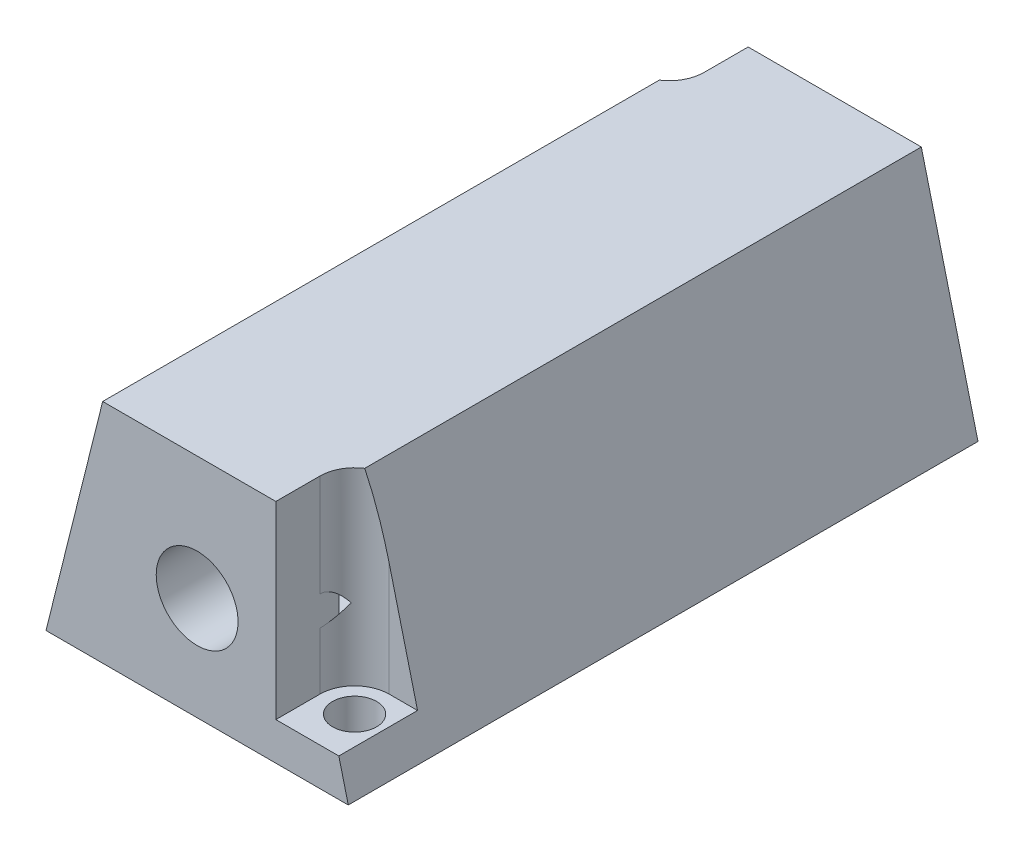
ISO-10303-21;
HEADER;
FILE_DESCRIPTION(('STEP AP214'),'2;1');
FILE_NAME('part.step','',(''),(''),'','','');
FILE_SCHEMA(('AUTOMOTIVE_DESIGN { 1 0 10303 214 1 1 1 1 }'));
ENDSEC;
DATA;
#1=APPLICATION_CONTEXT('core data for automotive mechanical design processes');
#2=APPLICATION_PROTOCOL_DEFINITION('international standard','automotive_design',2000,#1);
#3=PRODUCT_CONTEXT('',#1,'mechanical');
#4=PRODUCT('Part','Part','',(#3));
#5=PRODUCT_RELATED_PRODUCT_CATEGORY('part','',(#4));
#6=PRODUCT_DEFINITION_FORMATION('','',#4);
#7=PRODUCT_DEFINITION_CONTEXT('part definition',#1,'design');
#8=PRODUCT_DEFINITION('design','',#6,#7);
#9=PRODUCT_DEFINITION_SHAPE('','',#8);
#10=(LENGTH_UNIT() NAMED_UNIT(*) SI_UNIT(.MILLI.,.METRE.));
#11=(NAMED_UNIT(*) PLANE_ANGLE_UNIT() SI_UNIT($,.RADIAN.));
#12=(NAMED_UNIT(*) SI_UNIT($,.STERADIAN.) SOLID_ANGLE_UNIT());
#13=UNCERTAINTY_MEASURE_WITH_UNIT(LENGTH_MEASURE(1.E-05),#10,'distance_accuracy_value','');
#14=(GEOMETRIC_REPRESENTATION_CONTEXT(3) GLOBAL_UNCERTAINTY_ASSIGNED_CONTEXT((#13)) GLOBAL_UNIT_ASSIGNED_CONTEXT((#10,
#11,#12)) REPRESENTATION_CONTEXT('',''));
#15=CARTESIAN_POINT('',(0.,0.,0.));
#16=DIRECTION('',(0.,0.,1.));
#17=DIRECTION('',(1.,0.,0.));
#18=AXIS2_PLACEMENT_3D('',#15,#16,#17);
#19=CARTESIAN_POINT('',(8.36001491848114,22.3510638297872,50.));
#20=DIRECTION('',(0.,-1.,0.));
#21=DIRECTION('',(1.,0.,0.));
#22=AXIS2_PLACEMENT_3D('',#19,#20,#21);
#23=PLANE('',#22);
#24=DIRECTION('',(0.,0.,1.));
#25=VECTOR('',#24,1.);
#26=CARTESIAN_POINT('',(7.11001491848114,22.3510638297872,50.));
#27=LINE('',#26,#25);
#28=CARTESIAN_POINT('',(7.11001491848114,22.3510638297872,46.5));
#29=VERTEX_POINT('',#28);
#30=CARTESIAN_POINT('',(7.11001491848114,22.3510638297872,50.));
#31=VERTEX_POINT('',#30);
#32=EDGE_CURVE('E223',#29,#31,#27,.T.);
#33=ORIENTED_EDGE('',*,*,#32,.F.);
#34=CARTESIAN_POINT('',(9.86001491848114,22.3510638297872,46.5));
#35=DIRECTION('',(0.,-1.,0.));
#36=DIRECTION('',(1.,0.,0.));
#37=AXIS2_PLACEMENT_3D('',#34,#35,#36);
#38=CIRCLE('',#37,2.75);
#39=CARTESIAN_POINT('',(8.36001491848114,22.3510638297872,44.1951138856768));
#40=VERTEX_POINT('',#39);
#41=EDGE_CURVE('E230',#40,#29,#38,.F.);
#42=ORIENTED_EDGE('',*,*,#41,.F.);
#43=DIRECTION('',(0.,0.,-1.));
#44=VECTOR('',#43,1.);
#45=CARTESIAN_POINT('',(8.36001491848114,22.3510638297872,50.));
#46=LINE('',#45,#44);
#47=CARTESIAN_POINT('',(8.36001491848114,22.3510638297872,0.));
#48=VERTEX_POINT('',#47);
#49=EDGE_CURVE('E325',#40,#48,#46,.T.);
#50=ORIENTED_EDGE('',*,*,#49,.T.);
#51=DIRECTION('',(-1.,0.,0.));
#52=VECTOR('',#51,1.);
#53=CARTESIAN_POINT('',(8.36001491848114,22.3510638297872,0.));
#54=LINE('',#53,#52);
#55=CARTESIAN_POINT('',(-5.38998508151886,22.3510638297872,0.));
#56=VERTEX_POINT('',#55);
#57=EDGE_CURVE('E308',#48,#56,#54,.T.);
#58=ORIENTED_EDGE('',*,*,#57,.T.);
#59=DIRECTION('',(0.,0.,-1.));
#60=VECTOR('',#59,1.);
#61=CARTESIAN_POINT('',(-5.38998508151886,22.3510638297872,50.));
#62=LINE('',#61,#60);
#63=CARTESIAN_POINT('',(-5.38998508151886,22.3510638297872,3.50000000000003));
#64=VERTEX_POINT('',#63);
#65=EDGE_CURVE('E257',#64,#56,#62,.T.);
#66=ORIENTED_EDGE('',*,*,#65,.F.);
#67=CARTESIAN_POINT('',(-8.13998508151886,22.3510638297872,3.50000000000003));
#68=DIRECTION('',(0.,-1.,0.));
#69=DIRECTION('',(1.,0.,0.));
#70=AXIS2_PLACEMENT_3D('',#67,#68,#69);
#71=CIRCLE('',#70,2.75);
#72=CARTESIAN_POINT('',(-6.63998508151886,22.3510638297872,5.80488611432325));
#73=VERTEX_POINT('',#72);
#74=EDGE_CURVE('E262',#73,#64,#71,.F.);
#75=ORIENTED_EDGE('',*,*,#74,.F.);
#76=DIRECTION('',(0.,0.,-1.));
#77=VECTOR('',#76,1.);
#78=CARTESIAN_POINT('',(-6.63998508151886,22.3510638297872,50.));
#79=LINE('',#78,#77);
#80=CARTESIAN_POINT('',(-6.63998508151886,22.3510638297872,50.));
#81=VERTEX_POINT('',#80);
#82=EDGE_CURVE('E315',#81,#73,#79,.T.);
#83=ORIENTED_EDGE('',*,*,#82,.F.);
#84=DIRECTION('',(-1.,0.,0.));
#85=VECTOR('',#84,1.);
#86=CARTESIAN_POINT('',(8.36001491848114,22.3510638297872,50.));
#87=LINE('',#86,#85);
#88=EDGE_CURVE('E313',#31,#81,#87,.T.);
#89=ORIENTED_EDGE('',*,*,#88,.F.);
#90=EDGE_LOOP('',(#33,#42,#50,#58,#66,#75,#83,#89));
#91=FACE_BOUND('',#90,.T.);
#92=ADVANCED_FACE('F33',(#91),#23,.F.);
#93=CARTESIAN_POINT('',(0.,0.,50.));
#94=DIRECTION('',(0.,0.,1.));
#95=DIRECTION('',(1.,0.,0.));
#96=AXIS2_PLACEMENT_3D('',#93,#94,#95);
#97=PLANE('',#96);
#98=CARTESIAN_POINT('',(0.860014918481134,12.5649359562244,50.));
#99=DIRECTION('',(0.,0.,-1.));
#100=DIRECTION('',(-1.,0.,0.));
#101=AXIS2_PLACEMENT_3D('',#98,#99,#100);
#102=CIRCLE('',#101,3.25);
#103=CARTESIAN_POINT('',(-2.38998508151887,12.5649359562244,50.));
#104=VERTEX_POINT('',#103);
#105=EDGE_CURVE('E497',#104,#104,#102,.T.);
#106=ORIENTED_EDGE('',*,*,#105,.T.);
#107=EDGE_LOOP('',(#106));
#108=FACE_BOUND('',#107,.T.);
#109=DIRECTION('',(-1.,0.,0.));
#110=VECTOR('',#109,1.);
#111=CARTESIAN_POINT('',(0.,7.35106382978723,50.));
#112=LINE('',#111,#110);
#113=CARTESIAN_POINT('',(12.1100149184811,7.35106382978723,50.));
#114=VERTEX_POINT('',#113);
#115=CARTESIAN_POINT('',(7.11001491848114,7.35106382978723,50.));
#116=VERTEX_POINT('',#115);
#117=EDGE_CURVE('E217',#114,#116,#112,.T.);
#118=ORIENTED_EDGE('',*,*,#117,.T.);
#119=DIRECTION('',(0.,1.,0.));
#120=VECTOR('',#119,1.);
#121=CARTESIAN_POINT('',(7.11001491848114,0.,50.));
#122=LINE('',#121,#120);
#123=EDGE_CURVE('E220',#116,#31,#122,.T.);
#124=ORIENTED_EDGE('',*,*,#123,.T.);
#125=ORIENTED_EDGE('',*,*,#88,.T.);
#126=DIRECTION('',(-0.242535625036333,-0.970142500145332,0.));
#127=VECTOR('',#126,1.);
#128=CARTESIAN_POINT('',(-6.63998508151886,22.3510638297872,50.));
#129=LINE('',#128,#127);
#130=CARTESIAN_POINT('',(-11.1399850815189,4.35106382978723,50.));
#131=VERTEX_POINT('',#130);
#132=EDGE_CURVE('E304',#81,#131,#129,.T.);
#133=ORIENTED_EDGE('',*,*,#132,.T.);
#134=DIRECTION('',(1.,0.,0.));
#135=VECTOR('',#134,1.);
#136=CARTESIAN_POINT('',(-11.1399850815189,4.35106382978723,50.));
#137=LINE('',#136,#135);
#138=CARTESIAN_POINT('',(12.8600149184811,4.35106382978723,50.));
#139=VERTEX_POINT('',#138);
#140=EDGE_CURVE('E307',#131,#139,#137,.T.);
#141=ORIENTED_EDGE('',*,*,#140,.T.);
#142=DIRECTION('',(-0.242535625036333,0.970142500145332,0.));
#143=VECTOR('',#142,1.);
#144=CARTESIAN_POINT('',(12.8600149184811,4.35106382978723,50.));
#145=LINE('',#144,#143);
#146=EDGE_CURVE('E310',#139,#114,#145,.T.);
#147=ORIENTED_EDGE('',*,*,#146,.T.);
#148=EDGE_LOOP('',(#118,#124,#125,#133,#141,#147));
#149=FACE_BOUND('',#148,.T.);
#150=ADVANCED_FACE('F433',(#108,#149),#97,.T.);
#151=CARTESIAN_POINT('',(12.8600149184811,4.35106382978723,50.));
#152=DIRECTION('',(-0.970142500145332,-0.242535625036333,0.));
#153=DIRECTION('',(0.242535625036333,-0.970142500145332,0.));
#154=AXIS2_PLACEMENT_3D('',#151,#152,#153);
#155=PLANE('',#154);
#156=CARTESIAN_POINT('',(9.86001491848114,16.3510638297872,46.5));
#157=DIRECTION('',(-0.970142500145332,-0.242535625036333,0.));
#158=DIRECTION('',(0.242535625036333,-0.970142500145332,0.));
#159=AXIS2_PLACEMENT_3D('',#156,#157,#158);
#160=ELLIPSE('',#159,11.3385404704486,2.75);
#161=CARTESIAN_POINT('',(9.86001491848111,16.3510638297875,43.75));
#162=VERTEX_POINT('',#161);
#163=EDGE_CURVE('E228',#162,#40,#160,.F.);
#164=ORIENTED_EDGE('',*,*,#163,.F.);
#165=DIRECTION('',(-0.242535625036333,0.970142500145332,0.));
#166=VECTOR('',#165,1.);
#167=CARTESIAN_POINT('',(12.8600149184811,4.35106382978723,43.75));
#168=LINE('',#167,#166);
#169=CARTESIAN_POINT('',(12.1100149184811,7.35106382978723,43.75));
#170=VERTEX_POINT('',#169);
#171=EDGE_CURVE('E42',#170,#162,#168,.T.);
#172=ORIENTED_EDGE('',*,*,#171,.F.);
#173=DIRECTION('',(0.,0.,-1.));
#174=VECTOR('',#173,1.);
#175=CARTESIAN_POINT('',(12.1100149184811,7.35106382978723,50.));
#176=LINE('',#175,#174);
#177=EDGE_CURVE('E202',#114,#170,#176,.T.);
#178=ORIENTED_EDGE('',*,*,#177,.F.);
#179=ORIENTED_EDGE('',*,*,#146,.F.);
#180=DIRECTION('',(0.,0.,-1.));
#181=VECTOR('',#180,1.);
#182=CARTESIAN_POINT('',(12.8600149184811,4.35106382978723,50.));
#183=LINE('',#182,#181);
#184=CARTESIAN_POINT('',(12.8600149184811,4.35106382978723,0.));
#185=VERTEX_POINT('',#184);
#186=EDGE_CURVE('E327',#139,#185,#183,.T.);
#187=ORIENTED_EDGE('',*,*,#186,.T.);
#188=DIRECTION('',(-0.242535625036333,0.970142500145332,0.));
#189=VECTOR('',#188,1.);
#190=CARTESIAN_POINT('',(12.8600149184811,4.35106382978723,0.));
#191=LINE('',#190,#189);
#192=EDGE_CURVE('E319',#185,#48,#191,.T.);
#193=ORIENTED_EDGE('',*,*,#192,.T.);
#194=ORIENTED_EDGE('',*,*,#49,.F.);
#195=EDGE_LOOP('',(#164,#172,#178,#179,#187,#193,#194));
#196=FACE_BOUND('',#195,.T.);
#197=ADVANCED_FACE('F377',(#196),#155,.F.);
#198=CARTESIAN_POINT('',(4.32411653361889,7.06493595622438,50.));
#199=DIRECTION('',(-0.866025403784439,0.499999999999999,0.));
#200=DIRECTION('',(-0.5,-0.866025403784439,0.));
#201=AXIS2_PLACEMENT_3D('',#198,#199,#200);
#202=PLANE('',#201);
#203=DIRECTION('',(0.,0.,-1.));
#204=VECTOR('',#203,1.);
#205=CARTESIAN_POINT('',(7.11001491848114,11.8902535035299,50.));
#206=LINE('',#205,#204);
#207=CARTESIAN_POINT('',(7.11001491848114,11.8902535035299,46.5));
#208=VERTEX_POINT('',#207);
#209=CARTESIAN_POINT('',(7.11001491848114,11.8902535035299,45.));
#210=VERTEX_POINT('',#209);
#211=EDGE_CURVE('E356',#208,#210,#206,.T.);
#212=ORIENTED_EDGE('',*,*,#211,.F.);
#213=CARTESIAN_POINT('',(9.86001491848114,16.6533932243443,46.5));
#214=DIRECTION('',(-0.866025403784439,0.499999999999999,0.));
#215=DIRECTION('',(-0.5,-0.866025403784439,0.));
#216=AXIS2_PLACEMENT_3D('',#213,#214,#215);
#217=ELLIPSE('',#216,5.50000000000001,2.75);
#218=CARTESIAN_POINT('',(7.78821814875665,13.0649359562244,44.691642141345));
#219=VERTEX_POINT('',#218);
#220=EDGE_CURVE('E225',#208,#219,#217,.F.);
#221=ORIENTED_EDGE('',*,*,#220,.T.);
#222=DIRECTION('',(0.,0.,-1.));
#223=VECTOR('',#222,1.);
#224=CARTESIAN_POINT('',(7.78821814875665,13.0649359562244,50.));
#225=LINE('',#224,#223);
#226=CARTESIAN_POINT('',(7.78821814875665,13.0649359562244,0.));
#227=VERTEX_POINT('',#226);
#228=EDGE_CURVE('E295',#219,#227,#225,.T.);
#229=ORIENTED_EDGE('',*,*,#228,.T.);
#230=DIRECTION('',(0.499999999999999,0.866025403784439,0.));
#231=VECTOR('',#230,1.);
#232=CARTESIAN_POINT('',(4.32411653361889,7.06493595622438,0.));
#233=LINE('',#232,#231);
#234=CARTESIAN_POINT('',(4.32411653361889,7.06493595622438,0.));
#235=VERTEX_POINT('',#234);
#236=EDGE_CURVE('E282',#235,#227,#233,.T.);
#237=ORIENTED_EDGE('',*,*,#236,.F.);
#238=DIRECTION('',(0.,0.,-1.));
#239=VECTOR('',#238,1.);
#240=CARTESIAN_POINT('',(4.32411653361889,7.06493595622438,50.));
#241=LINE('',#240,#239);
#242=CARTESIAN_POINT('',(4.32411653361889,7.06493595622438,45.));
#243=VERTEX_POINT('',#242);
#244=EDGE_CURVE('E297',#243,#235,#241,.T.);
#245=ORIENTED_EDGE('',*,*,#244,.F.);
#246=DIRECTION('',(-0.5,-0.866025403784439,0.));
#247=VECTOR('',#246,1.);
#248=CARTESIAN_POINT('',(4.32411653361889,7.06493595622438,45.));
#249=LINE('',#248,#247);
#250=EDGE_CURVE('E49',#210,#243,#249,.T.);
#251=ORIENTED_EDGE('',*,*,#250,.F.);
#252=EDGE_LOOP('',(#212,#221,#229,#237,#245,#251));
#253=FACE_BOUND('',#252,.T.);
#254=ADVANCED_FACE('F411',(#253),#202,.T.);
#255=CARTESIAN_POINT('',(7.78821814875665,13.0649359562244,50.));
#256=DIRECTION('',(-0.866025403784438,-0.5,0.));
#257=DIRECTION('',(0.5,-0.866025403784439,0.));
#258=AXIS2_PLACEMENT_3D('',#255,#256,#257);
#259=PLANE('',#258);
#260=DIRECTION('',(0.,0.,1.));
#261=VECTOR('',#260,1.);
#262=CARTESIAN_POINT('',(7.11001491848114,14.2396184089189,50.));
#263=LINE('',#262,#261);
#264=CARTESIAN_POINT('',(7.11001491848114,14.2396184089189,45.));
#265=VERTEX_POINT('',#264);
#266=CARTESIAN_POINT('',(7.11001491848114,14.2396184089189,46.5));
#267=VERTEX_POINT('',#266);
#268=EDGE_CURVE('E57',#265,#267,#263,.T.);
#269=ORIENTED_EDGE('',*,*,#268,.F.);
#270=DIRECTION('',(0.5,-0.866025403784439,0.));
#271=VECTOR('',#270,1.);
#272=CARTESIAN_POINT('',(7.78821814875665,13.0649359562244,45.));
#273=LINE('',#272,#271);
#274=CARTESIAN_POINT('',(4.32411653361889,19.0649359562244,45.));
#275=VERTEX_POINT('',#274);
#276=EDGE_CURVE('E359',#275,#265,#273,.T.);
#277=ORIENTED_EDGE('',*,*,#276,.F.);
#278=DIRECTION('',(0.,0.,-1.));
#279=VECTOR('',#278,1.);
#280=CARTESIAN_POINT('',(4.32411653361889,19.0649359562244,50.));
#281=LINE('',#280,#279);
#282=CARTESIAN_POINT('',(4.32411653361889,19.0649359562244,0.));
#283=VERTEX_POINT('',#282);
#284=EDGE_CURVE('E293',#275,#283,#281,.T.);
#285=ORIENTED_EDGE('',*,*,#284,.T.);
#286=DIRECTION('',(-0.5,0.866025403784438,0.));
#287=VECTOR('',#286,1.);
#288=CARTESIAN_POINT('',(7.78821814875665,13.0649359562244,0.));
#289=LINE('',#288,#287);
#290=EDGE_CURVE('E285',#227,#283,#289,.T.);
#291=ORIENTED_EDGE('',*,*,#290,.F.);
#292=ORIENTED_EDGE('',*,*,#228,.F.);
#293=CARTESIAN_POINT('',(9.86001491848114,9.47647868810449,46.5));
#294=DIRECTION('',(-0.866025403784438,-0.5,0.));
#295=DIRECTION('',(0.5,-0.866025403784439,0.));
#296=AXIS2_PLACEMENT_3D('',#293,#294,#295);
#297=ELLIPSE('',#296,5.5,2.75);
#298=EDGE_CURVE('E342',#219,#267,#297,.F.);
#299=ORIENTED_EDGE('',*,*,#298,.T.);
#300=EDGE_LOOP('',(#269,#277,#285,#291,#292,#299));
#301=FACE_BOUND('',#300,.T.);
#302=ADVANCED_FACE('F346',(#301),#259,.T.);
#303=CARTESIAN_POINT('',(9.86001491848114,54.3510638297872,46.5));
#304=DIRECTION('',(0.,-1.,0.));
#305=DIRECTION('',(0.,0.,-1.));
#306=AXIS2_PLACEMENT_3D('',#303,#304,#305);
#307=CYLINDRICAL_SURFACE('',#306,1.75);
#308=CARTESIAN_POINT('',(9.86001491848114,4.35106382978723,46.5));
#309=DIRECTION('',(0.,-1.,0.));
#310=DIRECTION('',(0.,0.,1.));
#311=AXIS2_PLACEMENT_3D('',#308,#309,#310);
#312=CIRCLE('',#311,1.75);
#313=CARTESIAN_POINT('',(9.86001491848114,4.35106382978723,48.25));
#314=VERTEX_POINT('',#313);
#315=EDGE_CURVE('E267',#314,#314,#312,.T.);
#316=ORIENTED_EDGE('',*,*,#315,.T.);
#317=EDGE_LOOP('',(#316));
#318=FACE_BOUND('',#317,.T.);
#319=CARTESIAN_POINT('',(9.86001491848114,7.35106382978723,46.5));
#320=DIRECTION('',(0.,1.,0.));
#321=DIRECTION('',(0.,0.,1.));
#322=AXIS2_PLACEMENT_3D('',#319,#320,#321);
#323=CIRCLE('',#322,1.75);
#324=CARTESIAN_POINT('',(9.86001491848114,7.35106382978723,48.25));
#325=VERTEX_POINT('',#324);
#326=EDGE_CURVE('E210',#325,#325,#323,.F.);
#327=ORIENTED_EDGE('',*,*,#326,.F.);
#328=EDGE_LOOP('',(#327));
#329=FACE_BOUND('',#328,.T.);
#330=ADVANCED_FACE('F466',(#318,#329),#307,.F.);
#331=CARTESIAN_POINT('',(0.,0.,0.));
#332=DIRECTION('',(0.,0.,1.));
#333=DIRECTION('',(1.,0.,0.));
#334=AXIS2_PLACEMENT_3D('',#331,#332,#333);
#335=PLANE('',#334);
#336=DIRECTION('',(0.,-1.,0.));
#337=VECTOR('',#336,1.);
#338=CARTESIAN_POINT('',(-5.38998508151886,0.,0.));
#339=LINE('',#338,#337);
#340=CARTESIAN_POINT('',(-5.38998508151886,14.2396184089189,0.));
#341=VERTEX_POINT('',#340);
#342=EDGE_CURVE('E254',#56,#341,#339,.T.);
#343=ORIENTED_EDGE('',*,*,#342,.F.);
#344=ORIENTED_EDGE('',*,*,#57,.F.);
#345=ORIENTED_EDGE('',*,*,#192,.F.);
#346=DIRECTION('',(1.,0.,0.));
#347=VECTOR('',#346,1.);
#348=CARTESIAN_POINT('',(-11.1399850815189,4.35106382978723,0.));
#349=LINE('',#348,#347);
#350=CARTESIAN_POINT('',(-11.1399850815189,4.35106382978723,0.));
#351=VERTEX_POINT('',#350);
#352=EDGE_CURVE('E317',#351,#185,#349,.T.);
#353=ORIENTED_EDGE('',*,*,#352,.F.);
#354=DIRECTION('',(-0.242535625036333,-0.970142500145332,0.));
#355=VECTOR('',#354,1.);
#356=CARTESIAN_POINT('',(-6.63998508151886,22.3510638297872,0.));
#357=LINE('',#356,#355);
#358=CARTESIAN_POINT('',(-10.3899850815189,7.35106382978723,0.));
#359=VERTEX_POINT('',#358);
#360=EDGE_CURVE('E303',#359,#351,#357,.T.);
#361=ORIENTED_EDGE('',*,*,#360,.F.);
#362=DIRECTION('',(-1.,0.,0.));
#363=VECTOR('',#362,1.);
#364=CARTESIAN_POINT('',(0.,7.35106382978723,0.));
#365=LINE('',#364,#363);
#366=CARTESIAN_POINT('',(-5.38998508151886,7.35106382978723,0.));
#367=VERTEX_POINT('',#366);
#368=EDGE_CURVE('E249',#367,#359,#365,.T.);
#369=ORIENTED_EDGE('',*,*,#368,.F.);
#370=CARTESIAN_POINT('',(-5.38998508151886,11.8902535035299,0.));
#371=VERTEX_POINT('',#370);
#372=EDGE_CURVE('E251',#371,#367,#339,.T.);
#373=ORIENTED_EDGE('',*,*,#372,.F.);
#374=DIRECTION('',(0.5,-0.866025403784438,0.));
#375=VECTOR('',#374,1.);
#376=CARTESIAN_POINT('',(-6.06818831179437,13.0649359562244,0.));
#377=LINE('',#376,#375);
#378=CARTESIAN_POINT('',(-2.60408669665662,7.06493595622438,0.));
#379=VERTEX_POINT('',#378);
#380=EDGE_CURVE('E276',#371,#379,#377,.T.);
#381=ORIENTED_EDGE('',*,*,#380,.T.);
#382=DIRECTION('',(1.,0.,0.));
#383=VECTOR('',#382,1.);
#384=CARTESIAN_POINT('',(-2.60408669665662,7.06493595622438,0.));
#385=LINE('',#384,#383);
#386=EDGE_CURVE('E279',#379,#235,#385,.T.);
#387=ORIENTED_EDGE('',*,*,#386,.T.);
#388=ORIENTED_EDGE('',*,*,#236,.T.);
#389=ORIENTED_EDGE('',*,*,#290,.T.);
#390=DIRECTION('',(-1.,0.,0.));
#391=VECTOR('',#390,1.);
#392=CARTESIAN_POINT('',(4.32411653361889,19.0649359562244,0.));
#393=LINE('',#392,#391);
#394=CARTESIAN_POINT('',(-2.60408669665662,19.0649359562244,0.));
#395=VERTEX_POINT('',#394);
#396=EDGE_CURVE('E288',#283,#395,#393,.T.);
#397=ORIENTED_EDGE('',*,*,#396,.T.);
#398=DIRECTION('',(-0.5,-0.866025403784439,0.));
#399=VECTOR('',#398,1.);
#400=CARTESIAN_POINT('',(-2.60408669665662,19.0649359562244,0.));
#401=LINE('',#400,#399);
#402=EDGE_CURVE('E273',#395,#341,#401,.T.);
#403=ORIENTED_EDGE('',*,*,#402,.T.);
#404=EDGE_LOOP('',(#343,#344,#345,#353,#361,#369,#373,#381,#387,#388,#389,#397,#403));
#405=FACE_BOUND('',#404,.T.);
#406=ADVANCED_FACE('F385',(#405),#335,.F.);
#407=CARTESIAN_POINT('',(-6.63998508151886,22.3510638297872,50.));
#408=DIRECTION('',(0.970142500145332,-0.242535625036333,0.));
#409=DIRECTION('',(0.242535625036333,0.970142500145332,0.));
#410=AXIS2_PLACEMENT_3D('',#407,#408,#409);
#411=PLANE('',#410);
#412=CARTESIAN_POINT('',(-8.13998508151886,16.3510638297872,3.50000000000003));
#413=DIRECTION('',(0.970142500145332,-0.242535625036333,0.));
#414=DIRECTION('',(-0.242535625036333,-0.970142500145332,0.));
#415=AXIS2_PLACEMENT_3D('',#412,#413,#414);
#416=ELLIPSE('',#415,11.3385404704486,2.75);
#417=CARTESIAN_POINT('',(-8.13998508151886,16.3510638297872,6.25000000000003));
#418=VERTEX_POINT('',#417);
#419=EDGE_CURVE('E264',#418,#73,#416,.F.);
#420=ORIENTED_EDGE('',*,*,#419,.F.);
#421=DIRECTION('',(0.242535625036333,0.970142500145332,0.));
#422=VECTOR('',#421,1.);
#423=CARTESIAN_POINT('',(-6.63998508151886,22.3510638297873,6.25000000000004));
#424=LINE('',#423,#422);
#425=CARTESIAN_POINT('',(-10.3899850815189,7.35106382978723,6.25000000000002));
#426=VERTEX_POINT('',#425);
#427=EDGE_CURVE('E341',#426,#418,#424,.T.);
#428=ORIENTED_EDGE('',*,*,#427,.F.);
#429=DIRECTION('',(0.,0.,1.));
#430=VECTOR('',#429,1.);
#431=CARTESIAN_POINT('',(-10.3899850815189,7.35106382978723,50.));
#432=LINE('',#431,#430);
#433=EDGE_CURVE('E247',#359,#426,#432,.T.);
#434=ORIENTED_EDGE('',*,*,#433,.F.);
#435=ORIENTED_EDGE('',*,*,#360,.T.);
#436=DIRECTION('',(0.,0.,-1.));
#437=VECTOR('',#436,1.);
#438=CARTESIAN_POINT('',(-11.1399850815189,4.35106382978723,50.));
#439=LINE('',#438,#437);
#440=EDGE_CURVE('E330',#131,#351,#439,.T.);
#441=ORIENTED_EDGE('',*,*,#440,.F.);
#442=ORIENTED_EDGE('',*,*,#132,.F.);
#443=ORIENTED_EDGE('',*,*,#82,.T.);
#444=EDGE_LOOP('',(#420,#428,#434,#435,#441,#442,#443));
#445=FACE_BOUND('',#444,.T.);
#446=ADVANCED_FACE('F35',(#445),#411,.F.);
#447=CARTESIAN_POINT('',(-2.60408669665662,19.0649359562244,50.));
#448=DIRECTION('',(0.866025403784439,-0.5,0.));
#449=DIRECTION('',(0.5,0.866025403784439,0.));
#450=AXIS2_PLACEMENT_3D('',#447,#448,#449);
#451=PLANE('',#450);
#452=DIRECTION('',(0.5,0.866025403784439,0.));
#453=VECTOR('',#452,1.);
#454=CARTESIAN_POINT('',(-2.60408669665662,19.0649359562244,45.));
#455=LINE('',#454,#453);
#456=CARTESIAN_POINT('',(-6.06818831179437,13.0649359562244,45.));
#457=VERTEX_POINT('',#456);
#458=CARTESIAN_POINT('',(-2.60408669665662,19.0649359562244,45.));
#459=VERTEX_POINT('',#458);
#460=EDGE_CURVE('E355',#457,#459,#455,.T.);
#461=ORIENTED_EDGE('',*,*,#460,.F.);
#462=DIRECTION('',(0.,0.,-1.));
#463=VECTOR('',#462,1.);
#464=CARTESIAN_POINT('',(-6.06818831179437,13.0649359562244,50.));
#465=LINE('',#464,#463);
#466=CARTESIAN_POINT('',(-6.06818831179437,13.0649359562244,5.30835785865501));
#467=VERTEX_POINT('',#466);
#468=EDGE_CURVE('E301',#457,#467,#465,.T.);
#469=ORIENTED_EDGE('',*,*,#468,.T.);
#470=CARTESIAN_POINT('',(-8.13998508151886,9.47647868810447,3.50000000000003));
#471=DIRECTION('',(0.866025403784439,-0.5,0.));
#472=DIRECTION('',(-0.5,-0.866025403784439,0.));
#473=AXIS2_PLACEMENT_3D('',#470,#471,#472);
#474=ELLIPSE('',#473,5.50000000000001,2.75);
#475=CARTESIAN_POINT('',(-5.38998508151886,14.2396184089189,3.50000000000003));
#476=VERTEX_POINT('',#475);
#477=EDGE_CURVE('E259',#467,#476,#474,.F.);
#478=ORIENTED_EDGE('',*,*,#477,.T.);
#479=DIRECTION('',(0.,0.,-1.));
#480=VECTOR('',#479,1.);
#481=CARTESIAN_POINT('',(-5.38998508151886,14.2396184089189,50.));
#482=LINE('',#481,#480);
#483=EDGE_CURVE('E253',#476,#341,#482,.T.);
#484=ORIENTED_EDGE('',*,*,#483,.T.);
#485=ORIENTED_EDGE('',*,*,#402,.F.);
#486=DIRECTION('',(0.,0.,-1.));
#487=VECTOR('',#486,1.);
#488=CARTESIAN_POINT('',(-2.60408669665662,19.0649359562244,50.));
#489=LINE('',#488,#487);
#490=EDGE_CURVE('E291',#459,#395,#489,.T.);
#491=ORIENTED_EDGE('',*,*,#490,.F.);
#492=EDGE_LOOP('',(#461,#469,#478,#484,#485,#491));
#493=FACE_BOUND('',#492,.T.);
#494=ADVANCED_FACE('F398',(#493),#451,.T.);
#495=CARTESIAN_POINT('',(-6.06818831179437,13.0649359562244,50.));
#496=DIRECTION('',(0.866025403784438,0.5,0.));
#497=DIRECTION('',(-0.5,0.866025403784439,0.));
#498=AXIS2_PLACEMENT_3D('',#495,#496,#497);
#499=PLANE('',#498);
#500=DIRECTION('',(-0.5,0.866025403784439,0.));
#501=VECTOR('',#500,1.);
#502=CARTESIAN_POINT('',(-6.06818831179437,13.0649359562244,45.));
#503=LINE('',#502,#501);
#504=CARTESIAN_POINT('',(-2.60408669665662,7.06493595622438,45.));
#505=VERTEX_POINT('',#504);
#506=EDGE_CURVE('E365',#505,#457,#503,.T.);
#507=ORIENTED_EDGE('',*,*,#506,.F.);
#508=DIRECTION('',(0.,0.,-1.));
#509=VECTOR('',#508,1.);
#510=CARTESIAN_POINT('',(-2.60408669665662,7.06493595622438,50.));
#511=LINE('',#510,#509);
#512=EDGE_CURVE('E299',#505,#379,#511,.T.);
#513=ORIENTED_EDGE('',*,*,#512,.T.);
#514=ORIENTED_EDGE('',*,*,#380,.F.);
#515=DIRECTION('',(0.,0.,1.));
#516=VECTOR('',#515,1.);
#517=CARTESIAN_POINT('',(-5.38998508151886,11.8902535035299,50.));
#518=LINE('',#517,#516);
#519=CARTESIAN_POINT('',(-5.38998508151886,11.8902535035299,3.50000000000003));
#520=VERTEX_POINT('',#519);
#521=EDGE_CURVE('E333',#371,#520,#518,.T.);
#522=ORIENTED_EDGE('',*,*,#521,.T.);
#523=CARTESIAN_POINT('',(-8.13998508151886,16.6533932243443,3.50000000000003));
#524=DIRECTION('',(0.866025403784438,0.5,0.));
#525=DIRECTION('',(0.5,-0.866025403784439,0.));
#526=AXIS2_PLACEMENT_3D('',#523,#524,#525);
#527=ELLIPSE('',#526,5.5,2.75);
#528=EDGE_CURVE('E338',#520,#467,#527,.F.);
#529=ORIENTED_EDGE('',*,*,#528,.T.);
#530=ORIENTED_EDGE('',*,*,#468,.F.);
#531=EDGE_LOOP('',(#507,#513,#514,#522,#529,#530));
#532=FACE_BOUND('',#531,.T.);
#533=ADVANCED_FACE('F403',(#532),#499,.T.);
#534=CARTESIAN_POINT('',(-8.13998508151886,54.3510638297872,3.5));
#535=DIRECTION('',(0.,-1.,0.));
#536=DIRECTION('',(0.,0.,-1.));
#537=AXIS2_PLACEMENT_3D('',#534,#535,#536);
#538=CYLINDRICAL_SURFACE('',#537,1.75);
#539=CARTESIAN_POINT('',(-8.13998508151886,4.35106382978723,3.5));
#540=DIRECTION('',(0.,-1.,0.));
#541=DIRECTION('',(0.,0.,1.));
#542=AXIS2_PLACEMENT_3D('',#539,#540,#541);
#543=CIRCLE('',#542,1.75);
#544=CARTESIAN_POINT('',(-8.13998508151886,4.35106382978723,5.25));
#545=VERTEX_POINT('',#544);
#546=EDGE_CURVE('E270',#545,#545,#543,.T.);
#547=ORIENTED_EDGE('',*,*,#546,.T.);
#548=EDGE_LOOP('',(#547));
#549=FACE_BOUND('',#548,.T.);
#550=CARTESIAN_POINT('',(-8.13998508151886,7.35106382978723,3.5));
#551=DIRECTION('',(0.,1.,0.));
#552=DIRECTION('',(0.,0.,1.));
#553=AXIS2_PLACEMENT_3D('',#550,#551,#552);
#554=CIRCLE('',#553,1.75);
#555=CARTESIAN_POINT('',(-8.13998508151886,7.35106382978723,5.25));
#556=VERTEX_POINT('',#555);
#557=EDGE_CURVE('E246',#556,#556,#554,.F.);
#558=ORIENTED_EDGE('',*,*,#557,.F.);
#559=EDGE_LOOP('',(#558));
#560=FACE_BOUND('',#559,.T.);
#561=ADVANCED_FACE('F437',(#549,#560),#538,.F.);
#562=CARTESIAN_POINT('',(-11.1399850815189,4.35106382978723,50.));
#563=DIRECTION('',(0.,1.,0.));
#564=DIRECTION('',(-1.,0.,0.));
#565=AXIS2_PLACEMENT_3D('',#562,#563,#564);
#566=PLANE('',#565);
#567=ORIENTED_EDGE('',*,*,#315,.F.);
#568=EDGE_LOOP('',(#567));
#569=FACE_BOUND('',#568,.T.);
#570=ORIENTED_EDGE('',*,*,#546,.F.);
#571=EDGE_LOOP('',(#570));
#572=FACE_BOUND('',#571,.T.);
#573=ORIENTED_EDGE('',*,*,#352,.T.);
#574=ORIENTED_EDGE('',*,*,#186,.F.);
#575=ORIENTED_EDGE('',*,*,#140,.F.);
#576=ORIENTED_EDGE('',*,*,#440,.T.);
#577=EDGE_LOOP('',(#573,#574,#575,#576));
#578=FACE_BOUND('',#577,.T.);
#579=ADVANCED_FACE('F435',(#569,#572,#578),#566,.F.);
#580=CARTESIAN_POINT('',(-2.60408669665662,7.06493595622438,50.));
#581=DIRECTION('',(0.,1.,0.));
#582=DIRECTION('',(-1.,0.,0.));
#583=AXIS2_PLACEMENT_3D('',#580,#581,#582);
#584=PLANE('',#583);
#585=DIRECTION('',(-1.,0.,0.));
#586=VECTOR('',#585,1.);
#587=CARTESIAN_POINT('',(-2.60408669665662,7.06493595622438,45.));
#588=LINE('',#587,#586);
#589=EDGE_CURVE('E368',#243,#505,#588,.T.);
#590=ORIENTED_EDGE('',*,*,#589,.F.);
#591=ORIENTED_EDGE('',*,*,#244,.T.);
#592=ORIENTED_EDGE('',*,*,#386,.F.);
#593=ORIENTED_EDGE('',*,*,#512,.F.);
#594=EDGE_LOOP('',(#590,#591,#592,#593));
#595=FACE_BOUND('',#594,.T.);
#596=ADVANCED_FACE('F408',(#595),#584,.T.);
#597=CARTESIAN_POINT('',(4.32411653361889,19.0649359562244,50.));
#598=DIRECTION('',(0.,-1.,0.));
#599=DIRECTION('',(0.,0.,-1.));
#600=AXIS2_PLACEMENT_3D('',#597,#598,#599);
#601=PLANE('',#600);
#602=DIRECTION('',(1.,0.,0.));
#603=VECTOR('',#602,1.);
#604=CARTESIAN_POINT('',(4.32411653361889,19.0649359562244,45.));
#605=LINE('',#604,#603);
#606=EDGE_CURVE('E11',#459,#275,#605,.T.);
#607=ORIENTED_EDGE('',*,*,#606,.F.);
#608=ORIENTED_EDGE('',*,*,#490,.T.);
#609=ORIENTED_EDGE('',*,*,#396,.F.);
#610=ORIENTED_EDGE('',*,*,#284,.F.);
#611=EDGE_LOOP('',(#607,#608,#609,#610));
#612=FACE_BOUND('',#611,.T.);
#613=ADVANCED_FACE('F443',(#612),#601,.T.);
#614=CARTESIAN_POINT('',(-16.3899850815189,57.3510638297872,6.25));
#615=DIRECTION('',(0.,0.,-1.));
#616=DIRECTION('',(-1.,0.,0.));
#617=AXIS2_PLACEMENT_3D('',#614,#615,#616);
#618=PLANE('',#617);
#619=ORIENTED_EDGE('',*,*,#427,.T.);
#620=DIRECTION('',(0.,-1.,0.));
#621=VECTOR('',#620,1.);
#622=CARTESIAN_POINT('',(-8.13998508151886,57.3510638297872,6.25000000000003));
#623=LINE('',#622,#621);
#624=CARTESIAN_POINT('',(-8.13998508151886,7.35106382978723,6.25000000000003));
#625=VERTEX_POINT('',#624);
#626=EDGE_CURVE('E244',#418,#625,#623,.T.);
#627=ORIENTED_EDGE('',*,*,#626,.T.);
#628=DIRECTION('',(1.,0.,0.));
#629=VECTOR('',#628,1.);
#630=CARTESIAN_POINT('',(-16.3899850815189,7.35106382978723,6.25));
#631=LINE('',#630,#629);
#632=EDGE_CURVE('E232',#426,#625,#631,.T.);
#633=ORIENTED_EDGE('',*,*,#632,.F.);
#634=EDGE_LOOP('',(#619,#627,#633));
#635=FACE_BOUND('',#634,.T.);
#636=ADVANCED_FACE('F426',(#635),#618,.T.);
#637=CARTESIAN_POINT('',(-8.13998508151886,57.3510638297872,3.50000000000003));
#638=DIRECTION('',(0.,-1.,0.));
#639=DIRECTION('',(0.,0.,-1.));
#640=AXIS2_PLACEMENT_3D('',#637,#638,#639);
#641=CYLINDRICAL_SURFACE('',#640,2.75);
#642=ORIENTED_EDGE('',*,*,#419,.T.);
#643=ORIENTED_EDGE('',*,*,#74,.T.);
#644=DIRECTION('',(0.,-1.,0.));
#645=VECTOR('',#644,1.);
#646=CARTESIAN_POINT('',(-5.38998508151886,57.3510638297872,3.50000000000003));
#647=LINE('',#646,#645);
#648=EDGE_CURVE('E243',#64,#476,#647,.T.);
#649=ORIENTED_EDGE('',*,*,#648,.T.);
#650=ORIENTED_EDGE('',*,*,#477,.F.);
#651=ORIENTED_EDGE('',*,*,#528,.F.);
#652=CARTESIAN_POINT('',(-5.38998508151886,7.35106382978723,3.50000000000003));
#653=VERTEX_POINT('',#652);
#654=EDGE_CURVE('E241',#520,#653,#647,.T.);
#655=ORIENTED_EDGE('',*,*,#654,.T.);
#656=CARTESIAN_POINT('',(-8.13998508151886,7.35106382978723,3.50000000000003));
#657=DIRECTION('',(0.,1.,0.));
#658=DIRECTION('',(0.,0.,1.));
#659=AXIS2_PLACEMENT_3D('',#656,#657,#658);
#660=CIRCLE('',#659,2.75);
#661=EDGE_CURVE('E235',#625,#653,#660,.T.);
#662=ORIENTED_EDGE('',*,*,#661,.F.);
#663=ORIENTED_EDGE('',*,*,#626,.F.);
#664=EDGE_LOOP('',(#642,#643,#649,#650,#651,#655,#662,#663));
#665=FACE_BOUND('',#664,.T.);
#666=ADVANCED_FACE('F395',(#665),#641,.F.);
#667=CARTESIAN_POINT('',(-5.38998508151886,57.3510638297872,3.50000000000003));
#668=DIRECTION('',(-1.,0.,0.));
#669=DIRECTION('',(0.,0.,1.));
#670=AXIS2_PLACEMENT_3D('',#667,#668,#669);
#671=PLANE('',#670);
#672=ORIENTED_EDGE('',*,*,#65,.T.);
#673=ORIENTED_EDGE('',*,*,#342,.T.);
#674=ORIENTED_EDGE('',*,*,#483,.F.);
#675=ORIENTED_EDGE('',*,*,#648,.F.);
#676=EDGE_LOOP('',(#672,#673,#674,#675));
#677=FACE_BOUND('',#676,.T.);
#678=ADVANCED_FACE('F391',(#677),#671,.T.);
#679=ORIENTED_EDGE('',*,*,#372,.T.);
#680=DIRECTION('',(0.,0.,-1.));
#681=VECTOR('',#680,1.);
#682=CARTESIAN_POINT('',(-5.38998508151886,7.35106382978723,3.50000000000003));
#683=LINE('',#682,#681);
#684=EDGE_CURVE('E238',#653,#367,#683,.T.);
#685=ORIENTED_EDGE('',*,*,#684,.F.);
#686=ORIENTED_EDGE('',*,*,#654,.F.);
#687=ORIENTED_EDGE('',*,*,#521,.F.);
#688=EDGE_LOOP('',(#679,#685,#686,#687));
#689=FACE_BOUND('',#688,.T.);
#690=ADVANCED_FACE('F416',(#689),#671,.T.);
#691=CARTESIAN_POINT('',(-8.13998508151886,7.35106382978723,3.50000000000003));
#692=DIRECTION('',(0.,1.,0.));
#693=DIRECTION('',(0.,0.,1.));
#694=AXIS2_PLACEMENT_3D('',#691,#692,#693);
#695=PLANE('',#694);
#696=ORIENTED_EDGE('',*,*,#557,.T.);
#697=EDGE_LOOP('',(#696));
#698=FACE_BOUND('',#697,.T.);
#699=ORIENTED_EDGE('',*,*,#368,.T.);
#700=ORIENTED_EDGE('',*,*,#433,.T.);
#701=ORIENTED_EDGE('',*,*,#632,.T.);
#702=ORIENTED_EDGE('',*,*,#661,.T.);
#703=ORIENTED_EDGE('',*,*,#684,.T.);
#704=EDGE_LOOP('',(#699,#700,#701,#702,#703));
#705=FACE_BOUND('',#704,.T.);
#706=ADVANCED_FACE('F421',(#698,#705),#695,.T.);
#707=CARTESIAN_POINT('',(18.1100149184811,57.3510638297872,43.75));
#708=DIRECTION('',(0.,0.,1.));
#709=DIRECTION('',(1.,0.,0.));
#710=AXIS2_PLACEMENT_3D('',#707,#708,#709);
#711=PLANE('',#710);
#712=ORIENTED_EDGE('',*,*,#171,.T.);
#713=DIRECTION('',(0.,-1.,0.));
#714=VECTOR('',#713,1.);
#715=CARTESIAN_POINT('',(9.86001491848114,57.3510638297872,43.75));
#716=LINE('',#715,#714);
#717=CARTESIAN_POINT('',(9.86001491848114,7.35106382978723,43.75));
#718=VERTEX_POINT('',#717);
#719=EDGE_CURVE('E185',#162,#718,#716,.T.);
#720=ORIENTED_EDGE('',*,*,#719,.T.);
#721=DIRECTION('',(-1.,0.,0.));
#722=VECTOR('',#721,1.);
#723=CARTESIAN_POINT('',(18.1100149184811,7.35106382978723,43.75));
#724=LINE('',#723,#722);
#725=EDGE_CURVE('E188',#170,#718,#724,.T.);
#726=ORIENTED_EDGE('',*,*,#725,.F.);
#727=EDGE_LOOP('',(#712,#720,#726));
#728=FACE_BOUND('',#727,.T.);
#729=ADVANCED_FACE('F187',(#728),#711,.T.);
#730=CARTESIAN_POINT('',(9.86001491848114,57.3510638297872,46.5));
#731=DIRECTION('',(0.,-1.,0.));
#732=DIRECTION('',(0.,0.,-1.));
#733=AXIS2_PLACEMENT_3D('',#730,#731,#732);
#734=CYLINDRICAL_SURFACE('',#733,2.75);
#735=ORIENTED_EDGE('',*,*,#41,.T.);
#736=DIRECTION('',(0.,-1.,0.));
#737=VECTOR('',#736,1.);
#738=CARTESIAN_POINT('',(7.11001491848114,57.3510638297872,46.5));
#739=LINE('',#738,#737);
#740=EDGE_CURVE('E193',#29,#267,#739,.T.);
#741=ORIENTED_EDGE('',*,*,#740,.T.);
#742=ORIENTED_EDGE('',*,*,#298,.F.);
#743=ORIENTED_EDGE('',*,*,#220,.F.);
#744=CARTESIAN_POINT('',(7.11001491848114,7.35106382978723,46.5));
#745=VERTEX_POINT('',#744);
#746=EDGE_CURVE('E208',#208,#745,#739,.T.);
#747=ORIENTED_EDGE('',*,*,#746,.T.);
#748=CARTESIAN_POINT('',(9.86001491848114,7.35106382978723,46.5));
#749=DIRECTION('',(0.,1.,0.));
#750=DIRECTION('',(0.,0.,1.));
#751=AXIS2_PLACEMENT_3D('',#748,#749,#750);
#752=CIRCLE('',#751,2.75);
#753=EDGE_CURVE('E200',#718,#745,#752,.T.);
#754=ORIENTED_EDGE('',*,*,#753,.F.);
#755=ORIENTED_EDGE('',*,*,#719,.F.);
#756=ORIENTED_EDGE('',*,*,#163,.T.);
#757=EDGE_LOOP('',(#735,#741,#742,#743,#747,#754,#755,#756));
#758=FACE_BOUND('',#757,.T.);
#759=ADVANCED_FACE('F205',(#758),#734,.F.);
#760=CARTESIAN_POINT('',(7.11001491848114,57.3510638297872,46.5));
#761=DIRECTION('',(1.,0.,0.));
#762=DIRECTION('',(0.,0.,-1.));
#763=AXIS2_PLACEMENT_3D('',#760,#761,#762);
#764=PLANE('',#763);
#765=ORIENTED_EDGE('',*,*,#32,.T.);
#766=ORIENTED_EDGE('',*,*,#123,.F.);
#767=DIRECTION('',(0.,0.,1.));
#768=VECTOR('',#767,1.);
#769=CARTESIAN_POINT('',(7.11001491848114,7.35106382978723,46.5));
#770=LINE('',#769,#768);
#771=EDGE_CURVE('E203',#745,#116,#770,.T.);
#772=ORIENTED_EDGE('',*,*,#771,.F.);
#773=ORIENTED_EDGE('',*,*,#746,.F.);
#774=ORIENTED_EDGE('',*,*,#211,.T.);
#775=DIRECTION('',(0.,1.,0.));
#776=VECTOR('',#775,1.);
#777=CARTESIAN_POINT('',(7.11001491848114,22.3510638297872,45.));
#778=LINE('',#777,#776);
#779=EDGE_CURVE('E354',#210,#265,#778,.T.);
#780=ORIENTED_EDGE('',*,*,#779,.T.);
#781=ORIENTED_EDGE('',*,*,#268,.T.);
#782=ORIENTED_EDGE('',*,*,#740,.F.);
#783=EDGE_LOOP('',(#765,#766,#772,#773,#774,#780,#781,#782));
#784=FACE_BOUND('',#783,.T.);
#785=ADVANCED_FACE('F351',(#784),#764,.T.);
#786=CARTESIAN_POINT('',(9.86001491848114,7.35106382978723,46.5));
#787=DIRECTION('',(0.,1.,0.));
#788=DIRECTION('',(0.,0.,1.));
#789=AXIS2_PLACEMENT_3D('',#786,#787,#788);
#790=PLANE('',#789);
#791=ORIENTED_EDGE('',*,*,#177,.T.);
#792=ORIENTED_EDGE('',*,*,#725,.T.);
#793=ORIENTED_EDGE('',*,*,#753,.T.);
#794=ORIENTED_EDGE('',*,*,#771,.T.);
#795=ORIENTED_EDGE('',*,*,#117,.F.);
#796=EDGE_LOOP('',(#791,#792,#793,#794,#795));
#797=FACE_BOUND('',#796,.T.);
#798=ORIENTED_EDGE('',*,*,#326,.T.);
#799=EDGE_LOOP('',(#798));
#800=FACE_BOUND('',#799,.T.);
#801=ADVANCED_FACE('F197',(#797,#800),#790,.T.);
#802=CARTESIAN_POINT('',(0.,0.,45.));
#803=DIRECTION('',(0.,0.,-1.));
#804=DIRECTION('',(-1.,0.,0.));
#805=AXIS2_PLACEMENT_3D('',#802,#803,#804);
#806=PLANE('',#805);
#807=CARTESIAN_POINT('',(0.860014918481134,12.5649359562244,45.));
#808=DIRECTION('',(0.,0.,-1.));
#809=DIRECTION('',(-1.,0.,0.));
#810=AXIS2_PLACEMENT_3D('',#807,#808,#809);
#811=CIRCLE('',#810,3.25);
#812=CARTESIAN_POINT('',(-2.38998508151887,12.5649359562244,45.));
#813=VERTEX_POINT('',#812);
#814=EDGE_CURVE('E37',#813,#813,#811,.T.);
#815=ORIENTED_EDGE('',*,*,#814,.F.);
#816=EDGE_LOOP('',(#815));
#817=FACE_BOUND('',#816,.T.);
#818=ORIENTED_EDGE('',*,*,#779,.F.);
#819=ORIENTED_EDGE('',*,*,#250,.T.);
#820=ORIENTED_EDGE('',*,*,#589,.T.);
#821=ORIENTED_EDGE('',*,*,#506,.T.);
#822=ORIENTED_EDGE('',*,*,#460,.T.);
#823=ORIENTED_EDGE('',*,*,#606,.T.);
#824=ORIENTED_EDGE('',*,*,#276,.T.);
#825=EDGE_LOOP('',(#818,#819,#820,#821,#822,#823,#824));
#826=FACE_BOUND('',#825,.T.);
#827=ADVANCED_FACE('F406',(#817,#826),#806,.T.);
#828=CARTESIAN_POINT('',(0.860014918481134,12.5649359562244,50.));
#829=DIRECTION('',(0.,0.,-1.));
#830=DIRECTION('',(-1.,0.,0.));
#831=AXIS2_PLACEMENT_3D('',#828,#829,#830);
#832=CYLINDRICAL_SURFACE('',#831,3.25);
#833=ORIENTED_EDGE('',*,*,#814,.T.);
#834=EDGE_LOOP('',(#833));
#835=FACE_BOUND('',#834,.T.);
#836=ORIENTED_EDGE('',*,*,#105,.F.);
#837=EDGE_LOOP('',(#836));
#838=FACE_BOUND('',#837,.T.);
#839=ADVANCED_FACE('F502',(#835,#838),#832,.F.);
#840=CLOSED_SHELL('',(#92,#150,#197,#254,#302,#330,#406,#446,#494,#533,#561,#579,#596,#613,#636,
#666,#678,#690,#706,#729,#759,#785,#801,#827,#839));
#841=MANIFOLD_SOLID_BREP('B2',#840);
#842=ADVANCED_BREP_SHAPE_REPRESENTATION('',(#18,#841),#14);
#843=SHAPE_DEFINITION_REPRESENTATION(#9,#842);
ENDSEC;
END-ISO-10303-21;
